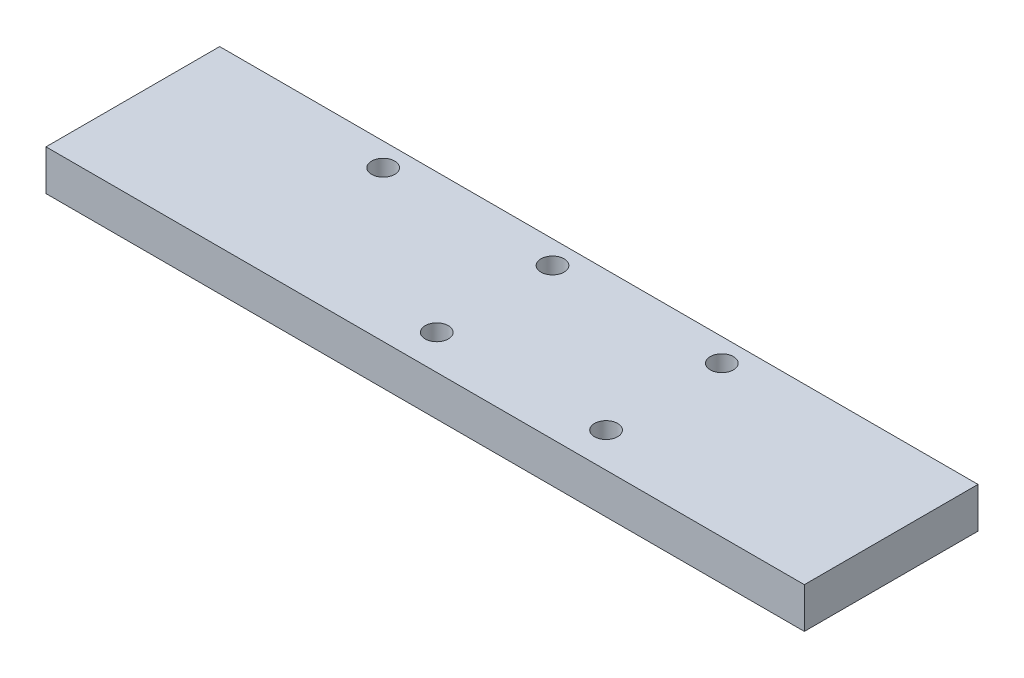
ISO-10303-21;
HEADER;
FILE_DESCRIPTION(('STEP AP214'),'2;1');
FILE_NAME('part.step','',(''),(''),'','','');
FILE_SCHEMA(('AUTOMOTIVE_DESIGN { 1 0 10303 214 1 1 1 1 }'));
ENDSEC;
DATA;
#1=APPLICATION_CONTEXT('core data for automotive mechanical design processes');
#2=APPLICATION_PROTOCOL_DEFINITION('international standard','automotive_design',2000,#1);
#3=PRODUCT_CONTEXT('',#1,'mechanical');
#4=PRODUCT('Part','Part','',(#3));
#5=PRODUCT_RELATED_PRODUCT_CATEGORY('part','',(#4));
#6=PRODUCT_DEFINITION_FORMATION('','',#4);
#7=PRODUCT_DEFINITION_CONTEXT('part definition',#1,'design');
#8=PRODUCT_DEFINITION('design','',#6,#7);
#9=PRODUCT_DEFINITION_SHAPE('','',#8);
#10=(LENGTH_UNIT() NAMED_UNIT(*) SI_UNIT(.MILLI.,.METRE.));
#11=(NAMED_UNIT(*) PLANE_ANGLE_UNIT() SI_UNIT($,.RADIAN.));
#12=(NAMED_UNIT(*) SI_UNIT($,.STERADIAN.) SOLID_ANGLE_UNIT());
#13=UNCERTAINTY_MEASURE_WITH_UNIT(LENGTH_MEASURE(1.E-05),#10,'distance_accuracy_value','');
#14=(GEOMETRIC_REPRESENTATION_CONTEXT(3) GLOBAL_UNCERTAINTY_ASSIGNED_CONTEXT((#13)) GLOBAL_UNIT_ASSIGNED_CONTEXT((#10,
#11,#12)) REPRESENTATION_CONTEXT('',''));
#15=CARTESIAN_POINT('',(0.,0.,0.));
#16=DIRECTION('',(0.,0.,1.));
#17=DIRECTION('',(1.,0.,0.));
#18=AXIS2_PLACEMENT_3D('',#15,#16,#17);
#19=CARTESIAN_POINT('',(-102.510460251046,7.,-65.1673640167364));
#20=DIRECTION('',(0.,0.,-1.));
#21=DIRECTION('',(-1.,0.,0.));
#22=AXIS2_PLACEMENT_3D('',#19,#20,#21);
#23=PLANE('',#22);
#24=DIRECTION('',(1.,0.,0.));
#25=VECTOR('',#24,1.);
#26=CARTESIAN_POINT('',(-102.510460251046,0.,-65.1673640167364));
#27=LINE('',#26,#25);
#28=CARTESIAN_POINT('',(-102.510460251046,0.,-65.1673640167364));
#29=VERTEX_POINT('',#28);
#30=CARTESIAN_POINT('',(28.4895397489539,0.,-65.1673640167364));
#31=VERTEX_POINT('',#30);
#32=EDGE_CURVE('E99',#29,#31,#27,.T.);
#33=ORIENTED_EDGE('',*,*,#32,.F.);
#34=DIRECTION('',(0.,-1.,0.));
#35=VECTOR('',#34,1.);
#36=CARTESIAN_POINT('',(-102.510460251046,7.,-65.1673640167364));
#37=LINE('',#36,#35);
#38=CARTESIAN_POINT('',(-102.510460251046,7.,-65.1673640167364));
#39=VERTEX_POINT('',#38);
#40=EDGE_CURVE('E11',#39,#29,#37,.T.);
#41=ORIENTED_EDGE('',*,*,#40,.F.);
#42=DIRECTION('',(1.,0.,0.));
#43=VECTOR('',#42,1.);
#44=CARTESIAN_POINT('',(-102.510460251046,7.,-65.1673640167364));
#45=LINE('',#44,#43);
#46=CARTESIAN_POINT('',(28.4895397489539,7.,-65.1673640167364));
#47=VERTEX_POINT('',#46);
#48=EDGE_CURVE('E93',#39,#47,#45,.T.);
#49=ORIENTED_EDGE('',*,*,#48,.T.);
#50=DIRECTION('',(0.,-1.,0.));
#51=VECTOR('',#50,1.);
#52=CARTESIAN_POINT('',(28.4895397489539,7.,-65.1673640167364));
#53=LINE('',#52,#51);
#54=EDGE_CURVE('E36',#47,#31,#53,.T.);
#55=ORIENTED_EDGE('',*,*,#54,.T.);
#56=EDGE_LOOP('',(#33,#41,#49,#55));
#57=FACE_BOUND('',#56,.T.);
#58=ADVANCED_FACE('F33',(#57),#23,.T.);
#59=CARTESIAN_POINT('',(-102.510460251046,7.,-65.1673640167364));
#60=DIRECTION('',(1.,0.,0.));
#61=DIRECTION('',(0.,0.,-1.));
#62=AXIS2_PLACEMENT_3D('',#59,#60,#61);
#63=PLANE('',#62);
#64=DIRECTION('',(0.,0.,1.));
#65=VECTOR('',#64,1.);
#66=CARTESIAN_POINT('',(-102.510460251046,0.,-65.1673640167364));
#67=LINE('',#66,#65);
#68=CARTESIAN_POINT('',(-102.510460251046,0.,-35.1673640167364));
#69=VERTEX_POINT('',#68);
#70=EDGE_CURVE('E66',#29,#69,#67,.T.);
#71=ORIENTED_EDGE('',*,*,#70,.T.);
#72=DIRECTION('',(0.,-1.,0.));
#73=VECTOR('',#72,1.);
#74=CARTESIAN_POINT('',(-102.510460251046,7.,-35.1673640167364));
#75=LINE('',#74,#73);
#76=CARTESIAN_POINT('',(-102.510460251046,7.,-35.1673640167364));
#77=VERTEX_POINT('',#76);
#78=EDGE_CURVE('E42',#77,#69,#75,.T.);
#79=ORIENTED_EDGE('',*,*,#78,.F.);
#80=DIRECTION('',(0.,0.,1.));
#81=VECTOR('',#80,1.);
#82=CARTESIAN_POINT('',(-102.510460251046,7.,-65.1673640167364));
#83=LINE('',#82,#81);
#84=EDGE_CURVE('E83',#39,#77,#83,.T.);
#85=ORIENTED_EDGE('',*,*,#84,.F.);
#86=ORIENTED_EDGE('',*,*,#40,.T.);
#87=EDGE_LOOP('',(#71,#79,#85,#86));
#88=FACE_BOUND('',#87,.T.);
#89=ADVANCED_FACE('F110',(#88),#63,.F.);
#90=CARTESIAN_POINT('',(-102.510460251046,7.,-35.1673640167364));
#91=DIRECTION('',(0.,0.,-1.));
#92=DIRECTION('',(-1.,0.,0.));
#93=AXIS2_PLACEMENT_3D('',#90,#91,#92);
#94=PLANE('',#93);
#95=DIRECTION('',(1.,0.,0.));
#96=VECTOR('',#95,1.);
#97=CARTESIAN_POINT('',(-102.510460251046,0.,-35.1673640167364));
#98=LINE('',#97,#96);
#99=CARTESIAN_POINT('',(28.4895397489539,0.,-35.1673640167364));
#100=VERTEX_POINT('',#99);
#101=EDGE_CURVE('E90',#69,#100,#98,.T.);
#102=ORIENTED_EDGE('',*,*,#101,.T.);
#103=DIRECTION('',(0.,-1.,0.));
#104=VECTOR('',#103,1.);
#105=CARTESIAN_POINT('',(28.4895397489539,7.,-35.1673640167364));
#106=LINE('',#105,#104);
#107=CARTESIAN_POINT('',(28.4895397489539,7.,-35.1673640167364));
#108=VERTEX_POINT('',#107);
#109=EDGE_CURVE('E87',#108,#100,#106,.T.);
#110=ORIENTED_EDGE('',*,*,#109,.F.);
#111=DIRECTION('',(1.,0.,0.));
#112=VECTOR('',#111,1.);
#113=CARTESIAN_POINT('',(-102.510460251046,7.,-35.1673640167364));
#114=LINE('',#113,#112);
#115=EDGE_CURVE('E78',#77,#108,#114,.T.);
#116=ORIENTED_EDGE('',*,*,#115,.F.);
#117=ORIENTED_EDGE('',*,*,#78,.T.);
#118=EDGE_LOOP('',(#102,#110,#116,#117));
#119=FACE_BOUND('',#118,.T.);
#120=ADVANCED_FACE('F88',(#119),#94,.F.);
#121=CARTESIAN_POINT('',(28.4895397489539,7.,-65.1673640167364));
#122=DIRECTION('',(1.,0.,0.));
#123=DIRECTION('',(0.,0.,-1.));
#124=AXIS2_PLACEMENT_3D('',#121,#122,#123);
#125=PLANE('',#124);
#126=DIRECTION('',(0.,0.,1.));
#127=VECTOR('',#126,1.);
#128=CARTESIAN_POINT('',(28.4895397489539,0.,-65.1673640167364));
#129=LINE('',#128,#127);
#130=EDGE_CURVE('E102',#31,#100,#129,.T.);
#131=ORIENTED_EDGE('',*,*,#130,.F.);
#132=ORIENTED_EDGE('',*,*,#54,.F.);
#133=DIRECTION('',(0.,0.,1.));
#134=VECTOR('',#133,1.);
#135=CARTESIAN_POINT('',(28.4895397489539,7.,-65.1673640167364));
#136=LINE('',#135,#134);
#137=EDGE_CURVE('E82',#47,#108,#136,.T.);
#138=ORIENTED_EDGE('',*,*,#137,.T.);
#139=ORIENTED_EDGE('',*,*,#109,.T.);
#140=EDGE_LOOP('',(#131,#132,#138,#139));
#141=FACE_BOUND('',#140,.T.);
#142=ADVANCED_FACE('F92',(#141),#125,.T.);
#143=CARTESIAN_POINT('',(0.,7.,0.));
#144=DIRECTION('',(0.,-1.,0.));
#145=DIRECTION('',(0.,0.,-1.));
#146=AXIS2_PLACEMENT_3D('',#143,#144,#145);
#147=PLANE('',#146);
#148=CARTESIAN_POINT('',(-70.2604602510461,7.,-61.1673640167364));
#149=DIRECTION('',(0.,-1.,0.));
#150=DIRECTION('',(0.,0.,-1.));
#151=AXIS2_PLACEMENT_3D('',#148,#149,#150);
#152=CIRCLE('',#151,2.);
#153=CARTESIAN_POINT('',(-70.2604602510461,7.,-63.1673640167364));
#154=VERTEX_POINT('',#153);
#155=EDGE_CURVE('E103',#154,#154,#152,.T.);
#156=ORIENTED_EDGE('',*,*,#155,.T.);
#157=EDGE_LOOP('',(#156));
#158=FACE_BOUND('',#157,.T.);
#159=CARTESIAN_POINT('',(-41.0104602510461,7.,-61.1673640167364));
#160=DIRECTION('',(0.,-1.,0.));
#161=DIRECTION('',(0.,0.,-1.));
#162=AXIS2_PLACEMENT_3D('',#159,#160,#161);
#163=CIRCLE('',#162,2.);
#164=CARTESIAN_POINT('',(-41.0104602510461,7.,-63.1673640167364));
#165=VERTEX_POINT('',#164);
#166=EDGE_CURVE('E159',#165,#165,#163,.T.);
#167=ORIENTED_EDGE('',*,*,#166,.T.);
#168=EDGE_LOOP('',(#167));
#169=FACE_BOUND('',#168,.T.);
#170=CARTESIAN_POINT('',(-11.7604602510461,7.,-61.1673640167364));
#171=DIRECTION('',(0.,-1.,0.));
#172=DIRECTION('',(0.,0.,-1.));
#173=AXIS2_PLACEMENT_3D('',#170,#171,#172);
#174=CIRCLE('',#173,2.);
#175=CARTESIAN_POINT('',(-11.7604602510461,7.,-63.1673640167364));
#176=VERTEX_POINT('',#175);
#177=EDGE_CURVE('E161',#176,#176,#174,.T.);
#178=ORIENTED_EDGE('',*,*,#177,.T.);
#179=EDGE_LOOP('',(#178));
#180=FACE_BOUND('',#179,.T.);
#181=CARTESIAN_POINT('',(-11.7604602510461,7.,-41.1673640167364));
#182=DIRECTION('',(0.,-1.,0.));
#183=DIRECTION('',(0.,0.,-1.));
#184=AXIS2_PLACEMENT_3D('',#181,#182,#183);
#185=CIRCLE('',#184,2.00000000000001);
#186=CARTESIAN_POINT('',(-11.7604602510461,7.,-43.1673640167364));
#187=VERTEX_POINT('',#186);
#188=EDGE_CURVE('E166',#187,#187,#185,.T.);
#189=ORIENTED_EDGE('',*,*,#188,.T.);
#190=EDGE_LOOP('',(#189));
#191=FACE_BOUND('',#190,.T.);
#192=CARTESIAN_POINT('',(-41.0104602510461,7.,-41.1673640167364));
#193=DIRECTION('',(0.,-1.,0.));
#194=DIRECTION('',(0.,0.,-1.));
#195=AXIS2_PLACEMENT_3D('',#192,#193,#194);
#196=CIRCLE('',#195,2.00000000000001);
#197=CARTESIAN_POINT('',(-41.0104602510461,7.,-43.1673640167364));
#198=VERTEX_POINT('',#197);
#199=EDGE_CURVE('E169',#198,#198,#196,.T.);
#200=ORIENTED_EDGE('',*,*,#199,.T.);
#201=EDGE_LOOP('',(#200));
#202=FACE_BOUND('',#201,.T.);
#203=ORIENTED_EDGE('',*,*,#48,.F.);
#204=ORIENTED_EDGE('',*,*,#84,.T.);
#205=ORIENTED_EDGE('',*,*,#115,.T.);
#206=ORIENTED_EDGE('',*,*,#137,.F.);
#207=EDGE_LOOP('',(#203,#204,#205,#206));
#208=FACE_BOUND('',#207,.T.);
#209=ADVANCED_FACE('F81',(#158,#169,#180,#191,#202,#208),#147,.F.);
#210=CARTESIAN_POINT('',(0.,0.,0.));
#211=DIRECTION('',(0.,-1.,0.));
#212=DIRECTION('',(0.,0.,-1.));
#213=AXIS2_PLACEMENT_3D('',#210,#211,#212);
#214=PLANE('',#213);
#215=CARTESIAN_POINT('',(-70.2604602510461,0.,-61.1673640167364));
#216=DIRECTION('',(0.,-1.,0.));
#217=DIRECTION('',(0.,0.,-1.));
#218=AXIS2_PLACEMENT_3D('',#215,#216,#217);
#219=CIRCLE('',#218,2.);
#220=CARTESIAN_POINT('',(-70.2604602510461,0.,-63.1673640167364));
#221=VERTEX_POINT('',#220);
#222=EDGE_CURVE('E157',#221,#221,#219,.T.);
#223=ORIENTED_EDGE('',*,*,#222,.F.);
#224=EDGE_LOOP('',(#223));
#225=FACE_BOUND('',#224,.T.);
#226=CARTESIAN_POINT('',(-41.0104602510461,0.,-61.1673640167364));
#227=DIRECTION('',(0.,-1.,0.));
#228=DIRECTION('',(0.,0.,-1.));
#229=AXIS2_PLACEMENT_3D('',#226,#227,#228);
#230=CIRCLE('',#229,2.);
#231=CARTESIAN_POINT('',(-41.0104602510461,0.,-63.1673640167364));
#232=VERTEX_POINT('',#231);
#233=EDGE_CURVE('E181',#232,#232,#230,.T.);
#234=ORIENTED_EDGE('',*,*,#233,.F.);
#235=EDGE_LOOP('',(#234));
#236=FACE_BOUND('',#235,.T.);
#237=CARTESIAN_POINT('',(-11.7604602510461,0.,-61.1673640167364));
#238=DIRECTION('',(0.,-1.,0.));
#239=DIRECTION('',(0.,0.,-1.));
#240=AXIS2_PLACEMENT_3D('',#237,#238,#239);
#241=CIRCLE('',#240,2.);
#242=CARTESIAN_POINT('',(-11.7604602510461,0.,-63.1673640167364));
#243=VERTEX_POINT('',#242);
#244=EDGE_CURVE('E178',#243,#243,#241,.T.);
#245=ORIENTED_EDGE('',*,*,#244,.F.);
#246=EDGE_LOOP('',(#245));
#247=FACE_BOUND('',#246,.T.);
#248=CARTESIAN_POINT('',(-11.7604602510461,0.,-41.1673640167364));
#249=DIRECTION('',(0.,-1.,0.));
#250=DIRECTION('',(0.,0.,-1.));
#251=AXIS2_PLACEMENT_3D('',#248,#249,#250);
#252=CIRCLE('',#251,2.00000000000001);
#253=CARTESIAN_POINT('',(-11.7604602510461,0.,-43.1673640167364));
#254=VERTEX_POINT('',#253);
#255=EDGE_CURVE('E175',#254,#254,#252,.T.);
#256=ORIENTED_EDGE('',*,*,#255,.F.);
#257=EDGE_LOOP('',(#256));
#258=FACE_BOUND('',#257,.T.);
#259=CARTESIAN_POINT('',(-41.0104602510461,0.,-41.1673640167364));
#260=DIRECTION('',(0.,-1.,0.));
#261=DIRECTION('',(0.,0.,-1.));
#262=AXIS2_PLACEMENT_3D('',#259,#260,#261);
#263=CIRCLE('',#262,2.00000000000001);
#264=CARTESIAN_POINT('',(-41.0104602510461,0.,-43.1673640167364));
#265=VERTEX_POINT('',#264);
#266=EDGE_CURVE('E172',#265,#265,#263,.T.);
#267=ORIENTED_EDGE('',*,*,#266,.F.);
#268=EDGE_LOOP('',(#267));
#269=FACE_BOUND('',#268,.T.);
#270=ORIENTED_EDGE('',*,*,#32,.T.);
#271=ORIENTED_EDGE('',*,*,#130,.T.);
#272=ORIENTED_EDGE('',*,*,#101,.F.);
#273=ORIENTED_EDGE('',*,*,#70,.F.);
#274=EDGE_LOOP('',(#270,#271,#272,#273));
#275=FACE_BOUND('',#274,.T.);
#276=ADVANCED_FACE('F108',(#225,#236,#247,#258,#269,#275),#214,.T.);
#277=CARTESIAN_POINT('',(-41.0104602510461,10.,-41.1673640167364));
#278=DIRECTION('',(0.,-1.,0.));
#279=DIRECTION('',(0.,0.,-1.));
#280=AXIS2_PLACEMENT_3D('',#277,#278,#279);
#281=CYLINDRICAL_SURFACE('',#280,2.00000000000001);
#282=ORIENTED_EDGE('',*,*,#266,.T.);
#283=EDGE_LOOP('',(#282));
#284=FACE_BOUND('',#283,.T.);
#285=ORIENTED_EDGE('',*,*,#199,.F.);
#286=EDGE_LOOP('',(#285));
#287=FACE_BOUND('',#286,.T.);
#288=ADVANCED_FACE('F129',(#284,#287),#281,.F.);
#289=CARTESIAN_POINT('',(-11.7604602510461,10.,-41.1673640167364));
#290=DIRECTION('',(0.,-1.,0.));
#291=DIRECTION('',(0.,0.,-1.));
#292=AXIS2_PLACEMENT_3D('',#289,#290,#291);
#293=CYLINDRICAL_SURFACE('',#292,2.00000000000001);
#294=ORIENTED_EDGE('',*,*,#255,.T.);
#295=EDGE_LOOP('',(#294));
#296=FACE_BOUND('',#295,.T.);
#297=ORIENTED_EDGE('',*,*,#188,.F.);
#298=EDGE_LOOP('',(#297));
#299=FACE_BOUND('',#298,.T.);
#300=ADVANCED_FACE('F136',(#296,#299),#293,.F.);
#301=CARTESIAN_POINT('',(-11.7604602510461,10.,-61.1673640167364));
#302=DIRECTION('',(0.,-1.,0.));
#303=DIRECTION('',(0.,0.,-1.));
#304=AXIS2_PLACEMENT_3D('',#301,#302,#303);
#305=CYLINDRICAL_SURFACE('',#304,2.);
#306=ORIENTED_EDGE('',*,*,#244,.T.);
#307=EDGE_LOOP('',(#306));
#308=FACE_BOUND('',#307,.T.);
#309=ORIENTED_EDGE('',*,*,#177,.F.);
#310=EDGE_LOOP('',(#309));
#311=FACE_BOUND('',#310,.T.);
#312=ADVANCED_FACE('F140',(#308,#311),#305,.F.);
#313=CARTESIAN_POINT('',(-41.0104602510461,10.,-61.1673640167364));
#314=DIRECTION('',(0.,-1.,0.));
#315=DIRECTION('',(0.,0.,-1.));
#316=AXIS2_PLACEMENT_3D('',#313,#314,#315);
#317=CYLINDRICAL_SURFACE('',#316,2.);
#318=ORIENTED_EDGE('',*,*,#233,.T.);
#319=EDGE_LOOP('',(#318));
#320=FACE_BOUND('',#319,.T.);
#321=ORIENTED_EDGE('',*,*,#166,.F.);
#322=EDGE_LOOP('',(#321));
#323=FACE_BOUND('',#322,.T.);
#324=ADVANCED_FACE('F144',(#320,#323),#317,.F.);
#325=CARTESIAN_POINT('',(-70.2604602510461,10.,-61.1673640167364));
#326=DIRECTION('',(0.,-1.,0.));
#327=DIRECTION('',(0.,0.,-1.));
#328=AXIS2_PLACEMENT_3D('',#325,#326,#327);
#329=CYLINDRICAL_SURFACE('',#328,2.);
#330=ORIENTED_EDGE('',*,*,#222,.T.);
#331=EDGE_LOOP('',(#330));
#332=FACE_BOUND('',#331,.T.);
#333=ORIENTED_EDGE('',*,*,#155,.F.);
#334=EDGE_LOOP('',(#333));
#335=FACE_BOUND('',#334,.T.);
#336=ADVANCED_FACE('F148',(#332,#335),#329,.F.);
#337=CLOSED_SHELL('',(#58,#89,#120,#142,#209,#276,#288,#300,#312,#324,#336));
#338=MANIFOLD_SOLID_BREP('B2',#337);
#339=ADVANCED_BREP_SHAPE_REPRESENTATION('',(#18,#338),#14);
#340=SHAPE_DEFINITION_REPRESENTATION(#9,#339);
ENDSEC;
END-ISO-10303-21;
